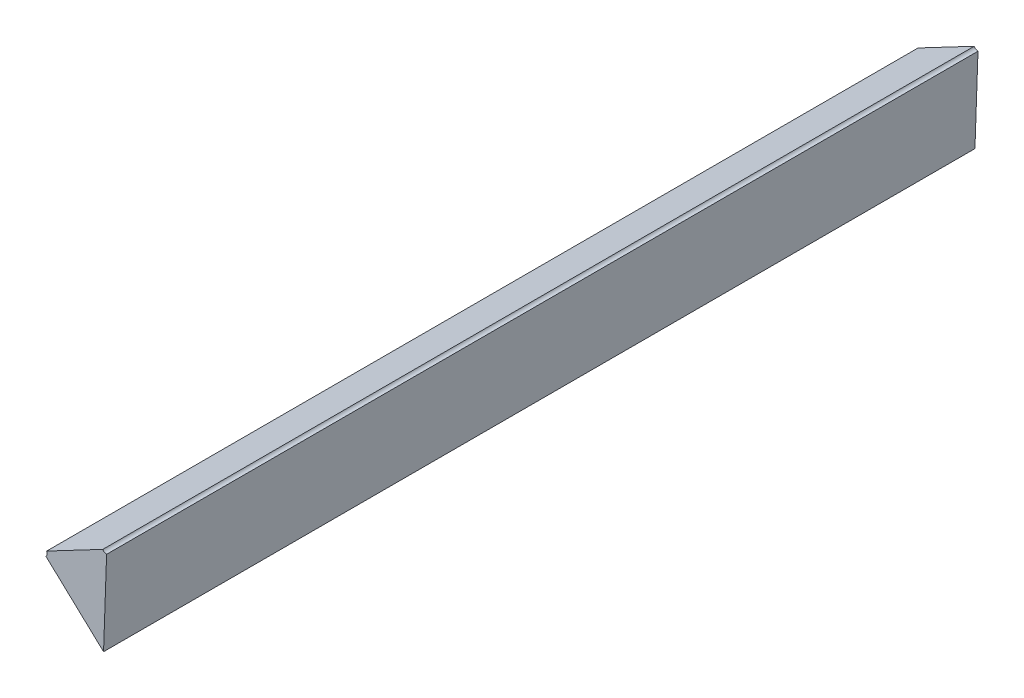
ISO-10303-21;
HEADER;
FILE_DESCRIPTION(('STEP AP214'),'2;1');
FILE_NAME('part.step','',(''),(''),'','','');
FILE_SCHEMA(('AUTOMOTIVE_DESIGN { 1 0 10303 214 1 1 1 1 }'));
ENDSEC;
DATA;
#1=APPLICATION_CONTEXT('core data for automotive mechanical design processes');
#2=APPLICATION_PROTOCOL_DEFINITION('international standard','automotive_design',2000,#1);
#3=PRODUCT_CONTEXT('',#1,'mechanical');
#4=PRODUCT('Part','Part','',(#3));
#5=PRODUCT_RELATED_PRODUCT_CATEGORY('part','',(#4));
#6=PRODUCT_DEFINITION_FORMATION('','',#4);
#7=PRODUCT_DEFINITION_CONTEXT('part definition',#1,'design');
#8=PRODUCT_DEFINITION('design','',#6,#7);
#9=PRODUCT_DEFINITION_SHAPE('','',#8);
#10=(LENGTH_UNIT() NAMED_UNIT(*) SI_UNIT(.MILLI.,.METRE.));
#11=(NAMED_UNIT(*) PLANE_ANGLE_UNIT() SI_UNIT($,.RADIAN.));
#12=(NAMED_UNIT(*) SI_UNIT($,.STERADIAN.) SOLID_ANGLE_UNIT());
#13=UNCERTAINTY_MEASURE_WITH_UNIT(LENGTH_MEASURE(1.E-05),#10,'distance_accuracy_value','');
#14=(GEOMETRIC_REPRESENTATION_CONTEXT(3) GLOBAL_UNCERTAINTY_ASSIGNED_CONTEXT((#13)) GLOBAL_UNIT_ASSIGNED_CONTEXT((#10,
#11,#12)) REPRESENTATION_CONTEXT('',''));
#15=CARTESIAN_POINT('',(0.,0.,0.));
#16=DIRECTION('',(0.,0.,1.));
#17=DIRECTION('',(1.,0.,0.));
#18=AXIS2_PLACEMENT_3D('',#15,#16,#17);
#19=CARTESIAN_POINT('',(-1.2891818129547,-0.38468925183984,0.));
#20=DIRECTION('',(0.,0.,1.));
#21=DIRECTION('',(1.,0.,0.));
#22=AXIS2_PLACEMENT_3D('',#19,#20,#21);
#23=PLANE('',#22);
#24=DIRECTION('',(0.729821846781318,-0.683637383384427,0.));
#25=VECTOR('',#24,1.);
#26=CARTESIAN_POINT('',(-1.2941929476078,-0.383497803520051,0.));
#27=LINE('',#26,#25);
#28=CARTESIAN_POINT('',(-1.2938280366844,-0.383839622211744,0.));
#29=VERTEX_POINT('',#28);
#30=CARTESIAN_POINT('',(-1.2872225203375,-0.390006506078917,0.));
#31=VERTEX_POINT('',#30);
#32=EDGE_CURVE('E11',#29,#31,#27,.T.);
#33=ORIENTED_EDGE('',*,*,#32,.F.);
#34=CARTESIAN_POINT('',(-1.2941929476078,-0.383497803520051,0.));
#35=DIRECTION('',(0.,0.,1.));
#36=DIRECTION('',(-1.,0.,0.));
#37=AXIS2_PLACEMENT_3D('',#34,#35,#36);
#38=CIRCLE('',#37,0.0005);
#39=CARTESIAN_POINT('',(-1.2937504278739,-0.383265045523118,0.));
#40=VERTEX_POINT('',#39);
#41=EDGE_CURVE('E24',#29,#40,#38,.T.);
#42=ORIENTED_EDGE('',*,*,#41,.T.);
#43=DIRECTION('',(-0.885039467737861,-0.465515993867326,0.));
#44=VECTOR('',#43,1.);
#45=CARTESIAN_POINT('',(-1.2868726607526,-0.379647454767227,0.));
#46=LINE('',#45,#44);
#47=CARTESIAN_POINT('',(-1.2873151804865,-0.379880212764161,0.));
#48=VERTEX_POINT('',#47);
#49=EDGE_CURVE('E136',#48,#40,#46,.T.);
#50=ORIENTED_EDGE('',*,*,#49,.F.);
#51=CARTESIAN_POINT('',(-1.2868726607526,-0.379647454767227,0.));
#52=DIRECTION('',(0.,0.,1.));
#53=DIRECTION('',(-1.,0.,0.));
#54=AXIS2_PLACEMENT_3D('',#51,#52,#53);
#55=CIRCLE('',#54,0.0005);
#56=CARTESIAN_POINT('',(-1.2868726607526,-0.380147454767227,0.));
#57=VERTEX_POINT('',#56);
#58=EDGE_CURVE('E134',#48,#57,#55,.T.);
#59=ORIENTED_EDGE('',*,*,#58,.T.);
#60=DIRECTION('',(0.,1.,0.));
#61=VECTOR('',#60,1.);
#62=CARTESIAN_POINT('',(-1.2868726607526,-0.390354849213328,0.));
#63=LINE('',#62,#61);
#64=EDGE_CURVE('E84',#31,#57,#63,.T.);
#65=ORIENTED_EDGE('',*,*,#64,.F.);
#66=EDGE_LOOP('',(#33,#42,#50,#59,#65));
#67=FACE_BOUND('',#66,.T.);
#68=ADVANCED_FACE('F17',(#67),#23,.F.);
#69=CARTESIAN_POINT('',(-1.2868726607526,-0.379647454767227,0.));
#70=DIRECTION('',(-0.465515993867326,0.885039467737861,0.));
#71=DIRECTION('',(-0.885039467737861,-0.465515993867326,0.));
#72=AXIS2_PLACEMENT_3D('',#69,#70,#71);
#73=PLANE('',#72);
#74=DIRECTION('',(0.,0.,-1.));
#75=VECTOR('',#74,1.);
#76=CARTESIAN_POINT('',(-1.2873151804865,-0.379880212764161,0.1));
#77=LINE('',#76,#75);
#78=CARTESIAN_POINT('',(-1.2873151804865,-0.379880212764161,0.1));
#79=VERTEX_POINT('',#78);
#80=EDGE_CURVE('E78',#79,#48,#77,.T.);
#81=ORIENTED_EDGE('',*,*,#80,.T.);
#82=ORIENTED_EDGE('',*,*,#49,.T.);
#83=DIRECTION('',(0.,0.,1.));
#84=VECTOR('',#83,1.);
#85=CARTESIAN_POINT('',(-1.2937504278739,-0.383265045523118,0.1));
#86=LINE('',#85,#84);
#87=CARTESIAN_POINT('',(-1.2937504278739,-0.383265045523118,0.1));
#88=VERTEX_POINT('',#87);
#89=EDGE_CURVE('E128',#40,#88,#86,.T.);
#90=ORIENTED_EDGE('',*,*,#89,.T.);
#91=DIRECTION('',(-0.885039467737861,-0.465515993867326,0.));
#92=VECTOR('',#91,1.);
#93=CARTESIAN_POINT('',(-1.2868726607526,-0.379647454767227,0.1));
#94=LINE('',#93,#92);
#95=EDGE_CURVE('E126',#79,#88,#94,.T.);
#96=ORIENTED_EDGE('',*,*,#95,.F.);
#97=EDGE_LOOP('',(#81,#82,#90,#96));
#98=FACE_BOUND('',#97,.T.);
#99=ADVANCED_FACE('F116',(#98),#73,.T.);
#100=CARTESIAN_POINT('',(-1.2941929476078,-0.383497803520051,0.));
#101=DIRECTION('',(-0.683637383384427,-0.729821846781318,0.));
#102=DIRECTION('',(0.729821846781318,-0.683637383384427,0.));
#103=AXIS2_PLACEMENT_3D('',#100,#101,#102);
#104=PLANE('',#103);
#105=CARTESIAN_POINT('',(-1.28723757167596,-0.390013030521637,0.));
#106=DIRECTION('',(0.,0.,1.));
#107=VECTOR('',#106,1.);
#108=LINE('',#105,#107);
#109=CARTESIAN_POINT('',(-1.2872225203375,-0.390006506078917,0.1));
#110=VERTEX_POINT('',#109);
#111=EDGE_CURVE('E94',#31,#110,#108,.T.);
#112=ORIENTED_EDGE('',*,*,#111,.T.);
#113=DIRECTION('',(0.729821846781318,-0.683637383384427,0.));
#114=VECTOR('',#113,1.);
#115=CARTESIAN_POINT('',(-1.2941929476078,-0.383497803520051,0.1));
#116=LINE('',#115,#114);
#117=CARTESIAN_POINT('',(-1.2938280366844,-0.383839622211744,0.1));
#118=VERTEX_POINT('',#117);
#119=EDGE_CURVE('E66',#118,#110,#116,.T.);
#120=ORIENTED_EDGE('',*,*,#119,.F.);
#121=DIRECTION('',(0.,0.,-1.));
#122=VECTOR('',#121,1.);
#123=CARTESIAN_POINT('',(-1.2938280366844,-0.383839622211744,0.1));
#124=LINE('',#123,#122);
#125=EDGE_CURVE('E70',#118,#29,#124,.T.);
#126=ORIENTED_EDGE('',*,*,#125,.T.);
#127=ORIENTED_EDGE('',*,*,#32,.T.);
#128=EDGE_LOOP('',(#112,#120,#126,#127));
#129=FACE_BOUND('',#128,.T.);
#130=ADVANCED_FACE('F113',(#129),#104,.T.);
#131=CARTESIAN_POINT('',(-1.2891818129547,-0.38468925183984,0.1));
#132=DIRECTION('',(0.,0.,1.));
#133=DIRECTION('',(1.,0.,0.));
#134=AXIS2_PLACEMENT_3D('',#131,#132,#133);
#135=PLANE('',#134);
#136=DIRECTION('',(0.,1.,0.));
#137=VECTOR('',#136,1.);
#138=CARTESIAN_POINT('',(-1.2868726607526,-0.390354849213328,0.1));
#139=LINE('',#138,#137);
#140=CARTESIAN_POINT('',(-1.2868726607526,-0.380147454767227,0.1));
#141=VERTEX_POINT('',#140);
#142=EDGE_CURVE('E60',#110,#141,#139,.T.);
#143=ORIENTED_EDGE('',*,*,#142,.T.);
#144=CARTESIAN_POINT('',(-1.2868726607526,-0.379647454767227,0.1));
#145=DIRECTION('',(0.,0.,-1.));
#146=DIRECTION('',(-1.,0.,0.));
#147=AXIS2_PLACEMENT_3D('',#144,#145,#146);
#148=CIRCLE('',#147,0.0005);
#149=EDGE_CURVE('E64',#141,#79,#148,.T.);
#150=ORIENTED_EDGE('',*,*,#149,.T.);
#151=ORIENTED_EDGE('',*,*,#95,.T.);
#152=CARTESIAN_POINT('',(-1.2941929476078,-0.383497803520051,0.1));
#153=DIRECTION('',(0.,0.,-1.));
#154=DIRECTION('',(-1.,0.,0.));
#155=AXIS2_PLACEMENT_3D('',#152,#153,#154);
#156=CIRCLE('',#155,0.0005);
#157=EDGE_CURVE('E80',#88,#118,#156,.T.);
#158=ORIENTED_EDGE('',*,*,#157,.T.);
#159=ORIENTED_EDGE('',*,*,#119,.T.);
#160=EDGE_LOOP('',(#143,#150,#151,#158,#159));
#161=FACE_BOUND('',#160,.T.);
#162=ADVANCED_FACE('F62',(#161),#135,.T.);
#163=CARTESIAN_POINT('',(-1.2868726607526,-0.390354849213328,0.));
#164=DIRECTION('',(1.,0.,0.));
#165=DIRECTION('',(0.,1.,0.));
#166=AXIS2_PLACEMENT_3D('',#163,#164,#165);
#167=PLANE('',#166);
#168=DIRECTION('',(0.,0.,1.));
#169=VECTOR('',#168,1.);
#170=CARTESIAN_POINT('',(-1.2868726607526,-0.380147454767227,0.1));
#171=LINE('',#170,#169);
#172=EDGE_CURVE('E76',#57,#141,#171,.T.);
#173=ORIENTED_EDGE('',*,*,#172,.T.);
#174=ORIENTED_EDGE('',*,*,#142,.F.);
#175=ORIENTED_EDGE('',*,*,#111,.F.);
#176=ORIENTED_EDGE('',*,*,#64,.T.);
#177=EDGE_LOOP('',(#173,#174,#175,#176));
#178=FACE_BOUND('',#177,.T.);
#179=ADVANCED_FACE('F83',(#178),#167,.T.);
#180=CARTESIAN_POINT('',(-1.2941929476078,-0.383497803520051,0.1));
#181=DIRECTION('',(0.,0.,1.));
#182=DIRECTION('',(-1.,0.,0.));
#183=AXIS2_PLACEMENT_3D('',#180,#181,#182);
#184=CYLINDRICAL_SURFACE('',#183,0.0005);
#185=ORIENTED_EDGE('',*,*,#89,.F.);
#186=ORIENTED_EDGE('',*,*,#41,.F.);
#187=ORIENTED_EDGE('',*,*,#125,.F.);
#188=ORIENTED_EDGE('',*,*,#157,.F.);
#189=EDGE_LOOP('',(#185,#186,#187,#188));
#190=FACE_BOUND('',#189,.T.);
#191=ADVANCED_FACE('F109',(#190),#184,.F.);
#192=CARTESIAN_POINT('',(-1.2868726607526,-0.379647454767227,0.1));
#193=DIRECTION('',(0.,0.,1.));
#194=DIRECTION('',(-1.,0.,0.));
#195=AXIS2_PLACEMENT_3D('',#192,#193,#194);
#196=CYLINDRICAL_SURFACE('',#195,0.0005);
#197=ORIENTED_EDGE('',*,*,#80,.F.);
#198=ORIENTED_EDGE('',*,*,#149,.F.);
#199=ORIENTED_EDGE('',*,*,#172,.F.);
#200=ORIENTED_EDGE('',*,*,#58,.F.);
#201=EDGE_LOOP('',(#197,#198,#199,#200));
#202=FACE_BOUND('',#201,.T.);
#203=ADVANCED_FACE('F74',(#202),#196,.F.);
#204=CLOSED_SHELL('',(#68,#99,#130,#162,#179,#191,#203));
#205=MANIFOLD_SOLID_BREP('B1',#204);
#206=ADVANCED_BREP_SHAPE_REPRESENTATION('',(#18,#205),#14);
#207=SHAPE_DEFINITION_REPRESENTATION(#9,#206);
ENDSEC;
END-ISO-10303-21;
